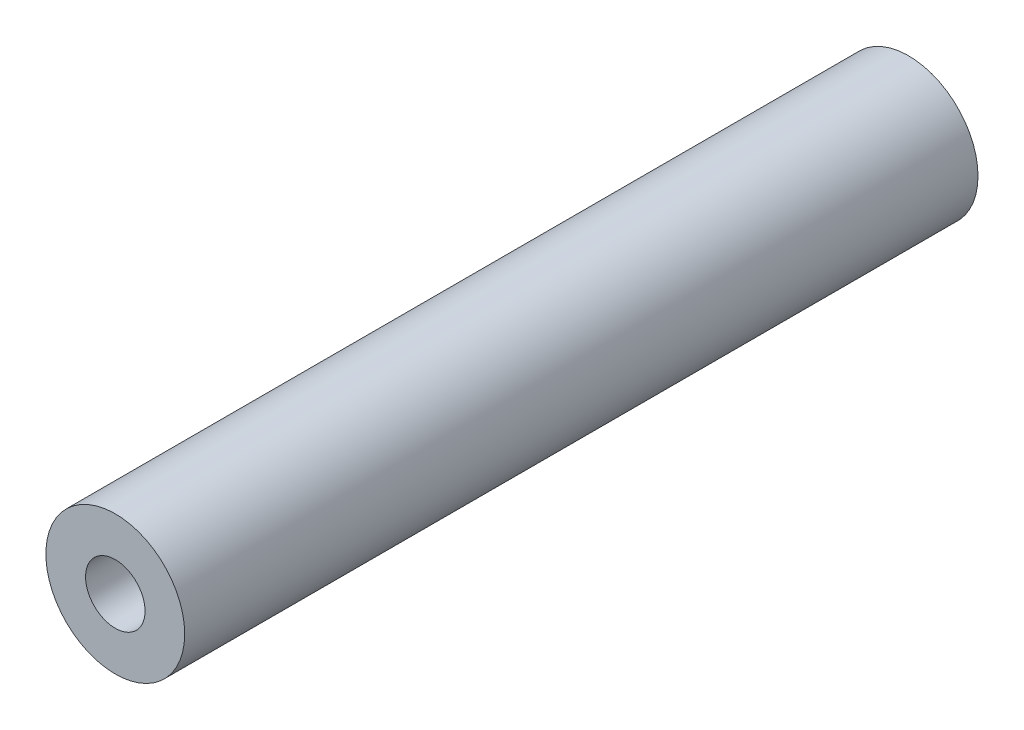
ISO-10303-21;
HEADER;
FILE_DESCRIPTION(('STEP AP214'),'2;1');
FILE_NAME('part.step','',(''),(''),'','','');
FILE_SCHEMA(('AUTOMOTIVE_DESIGN { 1 0 10303 214 1 1 1 1 }'));
ENDSEC;
DATA;
#1=APPLICATION_CONTEXT('core data for automotive mechanical design processes');
#2=APPLICATION_PROTOCOL_DEFINITION('international standard','automotive_design',2000,#1);
#3=PRODUCT_CONTEXT('',#1,'mechanical');
#4=PRODUCT('Part','Part','',(#3));
#5=PRODUCT_RELATED_PRODUCT_CATEGORY('part','',(#4));
#6=PRODUCT_DEFINITION_FORMATION('','',#4);
#7=PRODUCT_DEFINITION_CONTEXT('part definition',#1,'design');
#8=PRODUCT_DEFINITION('design','',#6,#7);
#9=PRODUCT_DEFINITION_SHAPE('','',#8);
#10=(LENGTH_UNIT() NAMED_UNIT(*) SI_UNIT(.MILLI.,.METRE.));
#11=(NAMED_UNIT(*) PLANE_ANGLE_UNIT() SI_UNIT($,.RADIAN.));
#12=(NAMED_UNIT(*) SI_UNIT($,.STERADIAN.) SOLID_ANGLE_UNIT());
#13=UNCERTAINTY_MEASURE_WITH_UNIT(LENGTH_MEASURE(1.E-05),#10,'distance_accuracy_value','');
#14=(GEOMETRIC_REPRESENTATION_CONTEXT(3) GLOBAL_UNCERTAINTY_ASSIGNED_CONTEXT((#13)) GLOBAL_UNIT_ASSIGNED_CONTEXT((#10,
#11,#12)) REPRESENTATION_CONTEXT('',''));
#15=CARTESIAN_POINT('',(0.,0.,0.));
#16=DIRECTION('',(0.,0.,1.));
#17=DIRECTION('',(1.,0.,0.));
#18=AXIS2_PLACEMENT_3D('',#15,#16,#17);
#19=CARTESIAN_POINT('',(0.,0.,40.));
#20=DIRECTION('',(0.,0.,-1.));
#21=DIRECTION('',(-1.,0.,0.));
#22=AXIS2_PLACEMENT_3D('',#19,#20,#21);
#23=CYLINDRICAL_SURFACE('',#22,3.5);
#24=CARTESIAN_POINT('',(0.,-3.5,5.4));
#25=CARTESIAN_POINT('',(0.075245103810024,-3.49999489858959,5.39999310372339));
#26=CARTESIAN_POINT('',(0.150620794863471,-3.49754506014853,5.39389757353814));
#27=CARTESIAN_POINT('',(0.299247536292527,-3.48798417170449,5.36972660753514));
#28=CARTESIAN_POINT('',(0.372492244292874,-3.48086045089214,5.35161860463971));
#29=CARTESIAN_POINT('',(0.514467745909182,-3.46271946449183,5.30418674535882));
#30=CARTESIAN_POINT('',(0.583212463131872,-3.4517149545485,5.27489960764829));
#31=CARTESIAN_POINT('',(0.714750379229858,-3.42689627557255,5.20608657867142));
#32=CARTESIAN_POINT('',(0.777545633725695,-3.4130830822064,5.16656424155675));
#33=CARTESIAN_POINT('',(0.898450705299275,-3.38331620319293,5.07643515100734));
#34=CARTESIAN_POINT('',(0.956243590785149,-3.36729607850433,5.02542534063182));
#35=CARTESIAN_POINT('',(1.06272250334931,-3.33522403834336,4.91461999756626));
#36=CARTESIAN_POINT('',(1.11140407499347,-3.31917211117655,4.85482019195178));
#37=CARTESIAN_POINT('',(1.20041219710502,-3.28805954257996,4.72490035083041));
#38=CARTESIAN_POINT('',(1.24027048683683,-3.27307481175466,4.65443945978376));
#39=CARTESIAN_POINT('',(1.307428303326,-3.24683553030755,4.50712452110597));
#40=CARTESIAN_POINT('',(1.33473379500008,-3.23557920870923,4.43027353050615));
#41=CARTESIAN_POINT('',(1.37472917637711,-3.21878450362573,4.27600136648553));
#42=CARTESIAN_POINT('',(1.38802577606395,-3.21300994248923,4.19876413509665));
#43=CARTESIAN_POINT('',(1.40152107314802,-3.20714802834401,4.04295550118491));
#44=CARTESIAN_POINT('',(1.40172621141926,-3.20705787865938,3.96438477376249));
#45=CARTESIAN_POINT('',(1.38949255725318,-3.21237350195996,3.81397032997937));
#46=CARTESIAN_POINT('',(1.3779327200136,-3.21739722526915,3.74203899991368));
#47=CARTESIAN_POINT('',(1.34396281620847,-3.23173331325485,3.6012383107953));
#48=CARTESIAN_POINT('',(1.32155085636324,-3.24104642625171,3.53236948832278));
#49=CARTESIAN_POINT('',(1.26608631278575,-3.26311639561971,3.39798751466277));
#50=CARTESIAN_POINT('',(1.23282590362072,-3.27593965496551,3.33257153266172));
#51=CARTESIAN_POINT('',(1.15675452251255,-3.30356681472923,3.2080089285469));
#52=CARTESIAN_POINT('',(1.11393996357059,-3.31837145819794,3.14886467341804));
#53=CARTESIAN_POINT('',(1.0160854196181,-3.3496871571959,3.0337131898386));
#54=CARTESIAN_POINT('',(0.960356224079444,-3.36624165483306,2.97830188938779));
#55=CARTESIAN_POINT('',(0.840220099201135,-3.39821877470797,2.87742086539857));
#56=CARTESIAN_POINT('',(0.775811445734104,-3.41364117111727,2.83195312181279));
#57=CARTESIAN_POINT('',(0.63845435682409,-3.44200276885184,2.75146778680892));
#58=CARTESIAN_POINT('',(0.565362343942534,-3.4548868906679,2.71667440316206));
#59=CARTESIAN_POINT('',(0.413716635838017,-3.47630379830131,2.66008249724536));
#60=CARTESIAN_POINT('',(0.335165737794772,-3.48483879423668,2.63827737370981));
#61=CARTESIAN_POINT('',(0.179827121325474,-3.49619297654837,2.60948619320621));
#62=CARTESIAN_POINT('',(0.103210305789874,-3.4993206208346,2.60169928202251));
#63=CARTESIAN_POINT('',(-0.050291716865472,-3.50047934957442,2.59880082962997));
#64=CARTESIAN_POINT('',(-0.127176849256747,-3.49851175507604,2.60368600291674));
#65=CARTESIAN_POINT('',(-0.275402917385392,-3.48990296944627,2.62540422678639));
#66=CARTESIAN_POINT('',(-0.346837744242833,-3.48347573941866,2.64169058624568));
#67=CARTESIAN_POINT('',(-0.485894799642547,-3.4668160898385,2.68500499581687));
#68=CARTESIAN_POINT('',(-0.553516537157392,-3.45658318149571,2.71203442576808));
#69=CARTESIAN_POINT('',(-0.685355150071692,-3.43291616339568,2.77694945777596));
#70=CARTESIAN_POINT('',(-0.749404615928784,-3.41939371185862,2.8151418304302));
#71=CARTESIAN_POINT('',(-0.870410513872589,-3.39061355321867,2.90095822673395));
#72=CARTESIAN_POINT('',(-0.927364088532788,-3.37535515177189,2.94858603004583));
#73=CARTESIAN_POINT('',(-1.03650613012017,-3.34351582346678,3.05560900906474));
#74=CARTESIAN_POINT('',(-1.08813175366425,-3.32691408997536,3.11557347905435));
#75=CARTESIAN_POINT('',(-1.1807258381896,-3.29519171041993,3.24360805810656));
#76=CARTESIAN_POINT('',(-1.22169254293626,-3.28007130868558,3.31167950023796));
#77=CARTESIAN_POINT('',(-1.29206525135214,-3.25300009935396,3.45502318621587));
#78=CARTESIAN_POINT('',(-1.32135541617412,-3.24108141619351,3.53035879944862));
#79=CARTESIAN_POINT('',(-1.36660735379371,-3.22226571434552,3.68551355620061));
#80=CARTESIAN_POINT('',(-1.38257896368852,-3.21536498987199,3.7653293440687));
#81=CARTESIAN_POINT('',(-1.39980093209488,-3.20790231509948,3.92098953124218));
#82=CARTESIAN_POINT('',(-1.40202795761201,-3.2069199470572,3.99670638771535));
#83=CARTESIAN_POINT('',(-1.39426221149427,-3.21030385223168,4.14738140039931));
#84=CARTESIAN_POINT('',(-1.38427099153965,-3.21466944627355,4.22233965173181));
#85=CARTESIAN_POINT('',(-1.35314995630755,-3.22788654355314,4.36633253289853));
#86=CARTESIAN_POINT('',(-1.33247624549968,-3.23655382279215,4.4354841921031));
#87=CARTESIAN_POINT('',(-1.28100381394371,-3.25726800862888,4.56936504072944));
#88=CARTESIAN_POINT('',(-1.25020229697567,-3.26931584844205,4.63409300282988));
#89=CARTESIAN_POINT('',(-1.17731093393181,-3.29629026723144,4.76132673348955));
#90=CARTESIAN_POINT('',(-1.13467573461164,-3.31134217619269,4.82349306909134));
#91=CARTESIAN_POINT('',(-1.04012448349005,-3.34224663060566,4.94009532204263));
#92=CARTESIAN_POINT('',(-0.988205634372684,-3.35809941633885,4.99452890048982));
#93=CARTESIAN_POINT('',(-0.872553854390723,-3.39005496961176,5.09774199728453));
#94=CARTESIAN_POINT('',(-0.808273200802296,-3.4061073057353,5.14592611482865));
#95=CARTESIAN_POINT('',(-0.671930224200045,-3.43560284699602,5.23083592983515));
#96=CARTESIAN_POINT('',(-0.599864303183066,-3.44904483765034,5.26755629850677));
#97=CARTESIAN_POINT('',(-0.451316643746642,-3.47157800371103,5.3276355506332));
#98=CARTESIAN_POINT('',(-0.374942132753787,-3.48074554138519,5.35123052649224));
#99=CARTESIAN_POINT('',(-0.219013582396855,-3.49401014346556,5.38504738466799));
#100=CARTESIAN_POINT('',(-0.139470468101239,-3.49812329646947,5.39531170572073));
#101=CARTESIAN_POINT('',(-0.0398386085236506,-3.49983129652896,5.39957676668479));
#102=CARTESIAN_POINT('',(-0.0199238821185308,-3.50000135078423,5.40000182604044));
#103=CARTESIAN_POINT('',(0.,-3.5,5.4));
#104=B_SPLINE_CURVE_WITH_KNOTS('',3,(#24,#25,#26,#27,#28,#29,#30,#31,#32,#33,#34,#35,#36,#37,
#38,#39,#40,#41,#42,#43,#44,#45,#46,#47,#48,#49,#50,#51,#52,#53,#54,#55,#56,#57,#58,#59,#60,#61,
#62,#63,#64,#65,#66,#67,#68,#69,#70,#71,#72,#73,#74,#75,#76,#77,#78,#79,#80,#81,#82,#83,#84,#85,
#86,#87,#88,#89,#90,#91,#92,#93,#94,#95,#96,#97,#98,#99,#100,#101,#102,#103),.UNSPECIFIED.,.T.,
.F.,(4,2,2,2,2,2,2,2,2,2,2,2,2,2,2,2,2,2,2,2,2,2,2,2,2,2,2,2,2,2,2,2,2,2,2,2,2,2,2,4),(0.,
0.22568209152515,0.451978545205554,0.677538020230108,0.90301927497589,1.13818167190278,
1.37345876454088,1.61920681173452,1.86483796182788,2.0993287371618,2.33370414438342,
2.55176829880961,2.76987051079233,2.99242388409171,3.21506095356728,3.4549084443059,
3.69480364987813,3.93943839213964,4.18394869279653,4.41398429169605,4.64396025499058,
4.86360318895056,5.08327434295658,5.30966459378784,5.53614571649278,5.7775793223709,
6.01905268330624,6.26286531598579,6.50649770852154,6.73259771374923,6.95866900794132,
7.17580022984138,7.39299145063613,7.62261827639685,7.85231440943875,8.09690296473685,
8.34160504548373,8.58175010709323,8.82112876683039,8.88088632127757),.UNSPECIFIED.);
#105=CARTESIAN_POINT('',(0.,-3.5,5.4));
#106=VERTEX_POINT('',#105);
#107=EDGE_CURVE('E58',#106,#106,#104,.T.);
#108=ORIENTED_EDGE('',*,*,#107,.T.);
#109=EDGE_LOOP('',(#108));
#110=FACE_BOUND('',#109,.T.);
#111=CARTESIAN_POINT('',(0.,-3.5,37.4));
#112=CARTESIAN_POINT('',(0.0752451038100239,-3.49999489858959,37.3999931037234));
#113=CARTESIAN_POINT('',(0.150620794863471,-3.49754506014853,37.3938975735381));
#114=CARTESIAN_POINT('',(0.299247536292527,-3.48798417170449,37.3697266075351));
#115=CARTESIAN_POINT('',(0.372492244292873,-3.48086045089214,37.3516186046397));
#116=CARTESIAN_POINT('',(0.51446774590918,-3.46271946449183,37.3041867453588));
#117=CARTESIAN_POINT('',(0.583212463131869,-3.45171495454851,37.2748996076483));
#118=CARTESIAN_POINT('',(0.714750379229855,-3.42689627557255,37.2060865786714));
#119=CARTESIAN_POINT('',(0.777545633725692,-3.4130830822064,37.1665642415568));
#120=CARTESIAN_POINT('',(0.898450705299273,-3.38331620319293,37.0764351510074));
#121=CARTESIAN_POINT('',(0.956243590785147,-3.36729607850433,37.0254253406318));
#122=CARTESIAN_POINT('',(1.0627225033493,-3.33522403834336,36.9146199975663));
#123=CARTESIAN_POINT('',(1.11140407499347,-3.31917211117655,36.8548201919518));
#124=CARTESIAN_POINT('',(1.20041219710502,-3.28805954257995,36.7249003508304));
#125=CARTESIAN_POINT('',(1.24027048683683,-3.27307481175466,36.6544394597838));
#126=CARTESIAN_POINT('',(1.307428303326,-3.24683553030755,36.507124521106));
#127=CARTESIAN_POINT('',(1.33473379500008,-3.23557920870923,36.4302735305061));
#128=CARTESIAN_POINT('',(1.37472917637711,-3.21878450362573,36.2760013664855));
#129=CARTESIAN_POINT('',(1.38802577606395,-3.21300994248924,36.1987641350967));
#130=CARTESIAN_POINT('',(1.40152107314802,-3.20714802834401,36.0429555011849));
#131=CARTESIAN_POINT('',(1.40172621141925,-3.20705787865938,35.9643847737625));
#132=CARTESIAN_POINT('',(1.38949255725318,-3.21237350195996,35.8139703299794));
#133=CARTESIAN_POINT('',(1.3779327200136,-3.21739722526915,35.7420389999137));
#134=CARTESIAN_POINT('',(1.34396281620847,-3.23173331325485,35.6012383107953));
#135=CARTESIAN_POINT('',(1.32155085636324,-3.24104642625171,35.5323694883228));
#136=CARTESIAN_POINT('',(1.26608631278575,-3.26311639561971,35.3979875146628));
#137=CARTESIAN_POINT('',(1.23282590362072,-3.27593965496551,35.3325715326617));
#138=CARTESIAN_POINT('',(1.15675452251255,-3.30356681472923,35.2080089285469));
#139=CARTESIAN_POINT('',(1.11393996357059,-3.31837145819794,35.148864673418));
#140=CARTESIAN_POINT('',(1.01608541961811,-3.34968715719589,35.0337131898386));
#141=CARTESIAN_POINT('',(0.960356224079448,-3.36624165483306,34.9783018893878));
#142=CARTESIAN_POINT('',(0.840220099201137,-3.39821877470797,34.8774208653986));
#143=CARTESIAN_POINT('',(0.775811445734104,-3.41364117111727,34.8319531218128));
#144=CARTESIAN_POINT('',(0.63845435682409,-3.44200276885184,34.7514677868089));
#145=CARTESIAN_POINT('',(0.565362343942534,-3.4548868906679,34.7166744031621));
#146=CARTESIAN_POINT('',(0.413716635838019,-3.47630379830131,34.6600824972454));
#147=CARTESIAN_POINT('',(0.335165737794774,-3.48483879423668,34.6382773737098));
#148=CARTESIAN_POINT('',(0.179827121325478,-3.49619297654837,34.6094861932062));
#149=CARTESIAN_POINT('',(0.103210305789878,-3.4993206208346,34.6016992820225));
#150=CARTESIAN_POINT('',(-0.0502917168654688,-3.50047934957442,34.59880082963));
#151=CARTESIAN_POINT('',(-0.127176849256743,-3.49851175507604,34.6036860029168));
#152=CARTESIAN_POINT('',(-0.275402917385389,-3.48990296944627,34.6254042267864));
#153=CARTESIAN_POINT('',(-0.346837744242831,-3.48347573941866,34.6416905862457));
#154=CARTESIAN_POINT('',(-0.485894799642546,-3.4668160898385,34.6850049958169));
#155=CARTESIAN_POINT('',(-0.55351653715739,-3.45658318149571,34.7120344257681));
#156=CARTESIAN_POINT('',(-0.685355150071688,-3.43291616339568,34.776949457776));
#157=CARTESIAN_POINT('',(-0.74940461592878,-3.41939371185863,34.8151418304302));
#158=CARTESIAN_POINT('',(-0.870410513872586,-3.39061355321867,34.900958226734));
#159=CARTESIAN_POINT('',(-0.927364088532787,-3.37535515177189,34.9485860300458));
#160=CARTESIAN_POINT('',(-1.03650613012017,-3.34351582346678,35.0556090090647));
#161=CARTESIAN_POINT('',(-1.08813175366424,-3.32691408997536,35.1155734790543));
#162=CARTESIAN_POINT('',(-1.18072583818959,-3.29519171041993,35.2436080581066));
#163=CARTESIAN_POINT('',(-1.22169254293625,-3.28007130868558,35.311679500238));
#164=CARTESIAN_POINT('',(-1.29206525135214,-3.25300009935396,35.4550231862159));
#165=CARTESIAN_POINT('',(-1.32135541617412,-3.24108141619352,35.5303587994486));
#166=CARTESIAN_POINT('',(-1.36660735379371,-3.22226571434552,35.6855135562006));
#167=CARTESIAN_POINT('',(-1.38257896368852,-3.21536498987199,35.7653293440687));
#168=CARTESIAN_POINT('',(-1.39980093209488,-3.20790231509948,35.9209895312422));
#169=CARTESIAN_POINT('',(-1.40202795761201,-3.2069199470572,35.9967063877153));
#170=CARTESIAN_POINT('',(-1.39426221149427,-3.21030385223169,36.1473814003993));
#171=CARTESIAN_POINT('',(-1.38427099153965,-3.21466944627356,36.2223396517318));
#172=CARTESIAN_POINT('',(-1.35314995630755,-3.22788654355315,36.3663325328985));
#173=CARTESIAN_POINT('',(-1.33247624549968,-3.23655382279215,36.4354841921031));
#174=CARTESIAN_POINT('',(-1.28100381394371,-3.25726800862888,36.5693650407294));
#175=CARTESIAN_POINT('',(-1.25020229697567,-3.26931584844205,36.6340930028299));
#176=CARTESIAN_POINT('',(-1.17731093393181,-3.29629026723144,36.7613267334896));
#177=CARTESIAN_POINT('',(-1.13467573461164,-3.31134217619269,36.8234930690913));
#178=CARTESIAN_POINT('',(-1.04012448349005,-3.34224663060566,36.9400953220426));
#179=CARTESIAN_POINT('',(-0.988205634372686,-3.35809941633885,36.9945289004898));
#180=CARTESIAN_POINT('',(-0.872553854390725,-3.39005496961176,37.0977419972845));
#181=CARTESIAN_POINT('',(-0.808273200802296,-3.4061073057353,37.1459261148286));
#182=CARTESIAN_POINT('',(-0.671930224200044,-3.43560284699602,37.2308359298352));
#183=CARTESIAN_POINT('',(-0.599864303183065,-3.44904483765034,37.2675562985068));
#184=CARTESIAN_POINT('',(-0.451316643746642,-3.47157800371103,37.3276355506332));
#185=CARTESIAN_POINT('',(-0.374942132753788,-3.48074554138519,37.3512305264922));
#186=CARTESIAN_POINT('',(-0.219013582396855,-3.49401014346556,37.385047384668));
#187=CARTESIAN_POINT('',(-0.139470468101239,-3.49812329646947,37.3953117057207));
#188=CARTESIAN_POINT('',(-0.0398386085236501,-3.49983129652896,37.3995767666848));
#189=CARTESIAN_POINT('',(-0.0199238821185305,-3.50000135078423,37.4000018260404));
#190=CARTESIAN_POINT('',(0.,-3.5,37.4));
#191=B_SPLINE_CURVE_WITH_KNOTS('',3,(#111,#112,#113,#114,#115,#116,#117,#118,#119,#120,#121,
#122,#123,#124,#125,#126,#127,#128,#129,#130,#131,#132,#133,#134,#135,#136,#137,#138,#139,#140,
#141,#142,#143,#144,#145,#146,#147,#148,#149,#150,#151,#152,#153,#154,#155,#156,#157,#158,#159,
#160,#161,#162,#163,#164,#165,#166,#167,#168,#169,#170,#171,#172,#173,#174,#175,#176,#177,#178,
#179,#180,#181,#182,#183,#184,#185,#186,#187,#188,#189,#190),.UNSPECIFIED.,.T.,.F.,(4,2,2,2,2,2,
2,2,2,2,2,2,2,2,2,2,2,2,2,2,2,2,2,2,2,2,2,2,2,2,2,2,2,2,2,2,2,2,2,4),(0.,0.22568209152515,
0.451978545205553,0.677538020230103,0.903019274975888,1.13818167190278,1.37345876454088,
1.61920681173452,1.86483796182788,2.0993287371618,2.33370414438341,2.5517682988096,
2.76987051079233,2.99242388409171,3.21506095356728,3.45490844430589,3.69480364987813,
3.93943839213964,4.18394869279653,4.41398429169605,4.64396025499057,4.86360318895056,
5.08327434295657,5.30966459378783,5.53614571649278,5.77757932237089,6.01905268330623,
6.26286531598579,6.50649770852154,6.73259771374923,6.95866900794132,7.17580022984138,
7.39299145063613,7.62261827639684,7.85231440943875,8.09690296473685,8.34160504548373,
8.58175010709322,8.82112876683039,8.88088632127756),.UNSPECIFIED.);
#192=CARTESIAN_POINT('',(0.,-3.5,37.4));
#193=VERTEX_POINT('',#192);
#194=EDGE_CURVE('E76',#193,#193,#191,.T.);
#195=ORIENTED_EDGE('',*,*,#194,.T.);
#196=EDGE_LOOP('',(#195));
#197=FACE_BOUND('',#196,.T.);
#198=CARTESIAN_POINT('',(0.,0.,40.));
#199=DIRECTION('',(0.,0.,1.));
#200=DIRECTION('',(1.,0.,0.));
#201=AXIS2_PLACEMENT_3D('',#198,#199,#200);
#202=CIRCLE('',#201,3.5);
#203=CARTESIAN_POINT('',(3.5,0.,40.));
#204=VERTEX_POINT('',#203);
#205=EDGE_CURVE('E10',#204,#204,#202,.T.);
#206=ORIENTED_EDGE('',*,*,#205,.F.);
#207=EDGE_LOOP('',(#206));
#208=FACE_BOUND('',#207,.T.);
#209=CARTESIAN_POINT('',(0.,0.,0.));
#210=DIRECTION('',(0.,0.,1.));
#211=DIRECTION('',(1.,0.,0.));
#212=AXIS2_PLACEMENT_3D('',#209,#210,#211);
#213=CIRCLE('',#212,3.5);
#214=CARTESIAN_POINT('',(3.5,0.,0.));
#215=VERTEX_POINT('',#214);
#216=EDGE_CURVE('E42',#215,#215,#213,.T.);
#217=ORIENTED_EDGE('',*,*,#216,.T.);
#218=EDGE_LOOP('',(#217));
#219=FACE_BOUND('',#218,.T.);
#220=ADVANCED_FACE('F30',(#110,#197,#208,#219),#23,.T.);
#221=CARTESIAN_POINT('',(0.,0.,40.));
#222=DIRECTION('',(0.,0.,1.));
#223=DIRECTION('',(1.,0.,0.));
#224=AXIS2_PLACEMENT_3D('',#221,#222,#223);
#225=PLANE('',#224);
#226=CARTESIAN_POINT('',(0.,0.,40.));
#227=DIRECTION('',(0.,0.,1.));
#228=DIRECTION('',(1.,0.,0.));
#229=AXIS2_PLACEMENT_3D('',#226,#227,#228);
#230=CIRCLE('',#229,1.5);
#231=CARTESIAN_POINT('',(1.5,0.,40.));
#232=VERTEX_POINT('',#231);
#233=EDGE_CURVE('E50',#232,#232,#230,.T.);
#234=ORIENTED_EDGE('',*,*,#233,.F.);
#235=EDGE_LOOP('',(#234));
#236=FACE_BOUND('',#235,.T.);
#237=ORIENTED_EDGE('',*,*,#205,.T.);
#238=EDGE_LOOP('',(#237));
#239=FACE_BOUND('',#238,.T.);
#240=ADVANCED_FACE('F94',(#236,#239),#225,.T.);
#241=CARTESIAN_POINT('',(0.,0.,0.));
#242=DIRECTION('',(0.,0.,1.));
#243=DIRECTION('',(1.,0.,0.));
#244=AXIS2_PLACEMENT_3D('',#241,#242,#243);
#245=PLANE('',#244);
#246=CARTESIAN_POINT('',(0.,0.,0.));
#247=DIRECTION('',(0.,0.,-1.));
#248=DIRECTION('',(-1.,0.,0.));
#249=AXIS2_PLACEMENT_3D('',#246,#247,#248);
#250=CIRCLE('',#249,2.);
#251=CARTESIAN_POINT('',(-2.,0.,0.));
#252=VERTEX_POINT('',#251);
#253=EDGE_CURVE('E81',#252,#252,#250,.T.);
#254=ORIENTED_EDGE('',*,*,#253,.F.);
#255=EDGE_LOOP('',(#254));
#256=FACE_BOUND('',#255,.T.);
#257=ORIENTED_EDGE('',*,*,#216,.F.);
#258=EDGE_LOOP('',(#257));
#259=FACE_BOUND('',#258,.T.);
#260=ADVANCED_FACE('F96',(#256,#259),#245,.F.);
#261=CARTESIAN_POINT('',(0.,0.,25.));
#262=DIRECTION('',(0.,0.,1.));
#263=DIRECTION('',(1.,0.,0.));
#264=AXIS2_PLACEMENT_3D('',#261,#262,#263);
#265=CYLINDRICAL_SURFACE('',#264,1.5);
#266=CARTESIAN_POINT('',(0.,-1.5,37.4));
#267=CARTESIAN_POINT('',(-0.0640950435898012,-1.49999810476752,37.3999980825945));
#268=CARTESIAN_POINT('',(-0.128203261420188,-1.49585775722874,37.3955646080593));
#269=CARTESIAN_POINT('',(-0.254231511438517,-1.47966634077285,37.378195233187));
#270=CARTESIAN_POINT('',(-0.316149985383407,-1.46760975338439,37.3652534016011));
#271=CARTESIAN_POINT('',(-0.435653650258473,-1.43666147835234,37.3319287185882));
#272=CARTESIAN_POINT('',(-0.493263524025158,-1.41781301737499,37.3115929186134));
#273=CARTESIAN_POINT('',(-0.603545856251819,-1.37449949866094,37.2646464311466));
#274=CARTESIAN_POINT('',(-0.65621711157044,-1.35003307726335,37.2380342201238));
#275=CARTESIAN_POINT('',(-0.776384430557704,-1.28590636968926,37.1678338611699));
#276=CARTESIAN_POINT('',(-0.841263828075761,-1.24410257595713,37.1217324601478));
#277=CARTESIAN_POINT('',(-0.96032201844431,-1.15470724278931,37.0216967122515));
#278=CARTESIAN_POINT('',(-1.01446437813477,-1.10709685378308,36.9677367383278));
#279=CARTESIAN_POINT('',(-1.09410972403101,-1.02704790659367,36.8747329836239));
#280=CARTESIAN_POINT('',(-1.12279412607445,-0.995519007918941,36.8375640334999));
#281=CARTESIAN_POINT('',(-1.17611972721624,-0.93191324772849,36.7608711692357));
#282=CARTESIAN_POINT('',(-1.2007615679446,-0.899836474064837,36.7213476301729));
#283=CARTESIAN_POINT('',(-1.24603236281641,-0.836020509823156,36.6399750587856));
#284=CARTESIAN_POINT('',(-1.26666963134969,-0.804280751986893,36.5981310817456));
#285=CARTESIAN_POINT('',(-1.30397463905043,-0.742259923002764,36.5117283809489));
#286=CARTESIAN_POINT('',(-1.32064768489069,-0.711976945588823,36.4671733878273));
#287=CARTESIAN_POINT('',(-1.3455836380728,-0.663266720561956,36.3880534896935));
#288=CARTESIAN_POINT('',(-1.35488117906104,-0.643957516465631,36.3543645504116));
#289=CARTESIAN_POINT('',(-1.37118437959276,-0.608466763372423,36.2848275746981));
#290=CARTESIAN_POINT('',(-1.37819290740772,-0.592281310616895,36.2489823075263));
#291=CARTESIAN_POINT('',(-1.38840796727428,-0.567859576833389,36.1822677555684));
#292=CARTESIAN_POINT('',(-1.39209375995248,-0.558682061093194,36.151829672968));
#293=CARTESIAN_POINT('',(-1.39746406931907,-0.545114614701663,36.0897632705108));
#294=CARTESIAN_POINT('',(-1.39915451710864,-0.540710498474953,36.0581387678841));
#295=CARTESIAN_POINT('',(-1.40035374267596,-0.537599996851102,35.9943352214479));
#296=CARTESIAN_POINT('',(-1.39984783727429,-0.538931958112776,35.962153882424));
#297=CARTESIAN_POINT('',(-1.39668645166934,-0.547068022818477,35.8985766065242));
#298=CARTESIAN_POINT('',(-1.39402593509137,-0.553884947048083,35.8671826876862));
#299=CARTESIAN_POINT('',(-1.38521762880518,-0.575636746274777,35.7922334938856));
#300=CARTESIAN_POINT('',(-1.37804463752851,-0.592834579615153,35.7494862127565));
#301=CARTESIAN_POINT('',(-1.36047366336353,-0.632121556262389,35.6669749164486));
#302=CARTESIAN_POINT('',(-1.35006160055544,-0.654231931595371,35.6272248858585));
#303=CARTESIAN_POINT('',(-1.32552237625272,-0.70269628329877,35.5473913256953));
#304=CARTESIAN_POINT('',(-1.31118060350002,-0.729241700735491,35.5074925412539));
#305=CARTESIAN_POINT('',(-1.27936813596317,-0.783721365900131,35.4299364144922));
#306=CARTESIAN_POINT('',(-1.26189443887906,-0.811656927510191,35.3922812695116));
#307=CARTESIAN_POINT('',(-1.20478652543379,-0.896155419621896,35.2821176468105));
#308=CARTESIAN_POINT('',(-1.16048231756084,-0.95337431394899,35.2124642022287));
#309=CARTESIAN_POINT('',(-1.05478065478574,-1.06965744462516,35.0750355708551));
#310=CARTESIAN_POINT('',(-0.992261512967609,-1.12847418664172,35.0079074751663));
#311=CARTESIAN_POINT('',(-0.85141002169809,-1.23814274705326,34.8847539738801));
#312=CARTESIAN_POINT('',(-0.773142733697489,-1.28902585520104,34.8286847083159));
#313=CARTESIAN_POINT('',(-0.634633965334391,-1.36042050484592,34.7506477807863));
#314=CARTESIAN_POINT('',(-0.579198330935333,-1.38505239417212,34.7238933807811));
#315=CARTESIAN_POINT('',(-0.463160810398619,-1.4280397544885,34.6773593374095));
#316=CARTESIAN_POINT('',(-0.402562624032901,-1.4463996738265,34.6575747504429));
#317=CARTESIAN_POINT('',(-0.276983848656247,-1.475623044531,34.626137936862));
#318=CARTESIAN_POINT('',(-0.21197302764821,-1.48642750320128,34.6145496991178));
#319=CARTESIAN_POINT('',(-0.0801160458413315,-1.49931930239748,34.6007269777605));
#320=CARTESIAN_POINT('',(-0.0132710845924479,-1.50141220975984,34.598486520747));
#321=CARTESIAN_POINT('',(0.1120735776974,-1.49696964573209,34.603247248845));
#322=CARTESIAN_POINT('',(0.170652011170823,-1.4913952065305,34.6092190804513));
#323=CARTESIAN_POINT('',(0.285623868807213,-1.47370383429039,34.6282074233806));
#324=CARTESIAN_POINT('',(0.342016932768793,-1.46158582758908,34.6412250907789));
#325=CARTESIAN_POINT('',(0.452069353137241,-1.43141048145882,34.6737371718716));
#326=CARTESIAN_POINT('',(0.50568204136064,-1.41327584920924,34.6933159073675));
#327=CARTESIAN_POINT('',(0.608545419511086,-1.37213205058534,34.7379300815498));
#328=CARTESIAN_POINT('',(0.65779495126971,-1.34912159542401,34.7629669629945));
#329=CARTESIAN_POINT('',(0.774905239500955,-1.2867969815693,34.8311862042441));
#330=CARTESIAN_POINT('',(0.839835145764479,-1.24506704156328,34.8771990730574));
#331=CARTESIAN_POINT('',(0.959012907346228,-1.15579651396183,34.977073570626));
#332=CARTESIAN_POINT('',(1.01322173952654,-1.1082356841826,35.0309626739718));
#333=CARTESIAN_POINT('',(1.09299741825808,-1.02823308499649,35.123876408531));
#334=CARTESIAN_POINT('',(1.12174188597574,-0.996706108059433,35.1610262581766));
#335=CARTESIAN_POINT('',(1.17518389937803,-0.933094902772498,35.2376830315749));
#336=CARTESIAN_POINT('',(1.19988206631047,-0.901010760805008,35.2771895922177));
#337=CARTESIAN_POINT('',(1.24526127527265,-0.837170486279038,35.3585252313268));
#338=CARTESIAN_POINT('',(1.26595084875642,-0.805413796381667,35.4003491281506));
#339=CARTESIAN_POINT('',(1.30335948831333,-0.743341967384873,35.4867068554011));
#340=CARTESIAN_POINT('',(1.32008381854399,-0.713024960272842,35.531236993236));
#341=CARTESIAN_POINT('',(1.34511797808286,-0.664212866891965,35.6103336691824));
#342=CARTESIAN_POINT('',(1.35446014448859,-0.644845095295752,35.6440281578057));
#343=CARTESIAN_POINT('',(1.37085233157459,-0.609217069989049,35.7135763951788));
#344=CARTESIAN_POINT('',(1.37790509960865,-0.592953101348057,35.7494274941972));
#345=CARTESIAN_POINT('',(1.38820652789297,-0.568353829326476,35.8161960016788));
#346=CARTESIAN_POINT('',(1.391932093237,-0.559085985696122,35.8466830443762));
#347=CARTESIAN_POINT('',(1.39737637039699,-0.54534068856858,35.9088617889395));
#348=CARTESIAN_POINT('',(1.39910109458525,-0.540848886849111,35.9405495847198));
#349=CARTESIAN_POINT('',(1.40035973091953,-0.537584750109142,36.0045040503349));
#350=CARTESIAN_POINT('',(1.39987845791979,-0.53885205783399,36.0367732048758));
#351=CARTESIAN_POINT('',(1.39675296913251,-0.546897751695353,36.100531883667));
#352=CARTESIAN_POINT('',(1.39410369235148,-0.553689032784739,36.1320194058803));
#353=CARTESIAN_POINT('',(1.38533400478294,-0.575354619595597,36.2069690999879));
#354=CARTESIAN_POINT('',(1.37820148371112,-0.592466426255628,36.2496354566346));
#355=CARTESIAN_POINT('',(1.36072269539434,-0.631581922223773,36.3319953873768));
#356=CARTESIAN_POINT('',(1.35036241654719,-0.65360681838119,36.371675045427));
#357=CARTESIAN_POINT('',(1.32593952026709,-0.701904795351851,36.4513778001375));
#358=CARTESIAN_POINT('',(1.31166241918742,-0.728370349638927,36.4912159467709));
#359=CARTESIAN_POINT('',(1.2799919308485,-0.78269806127693,36.568655614103));
#360=CARTESIAN_POINT('',(1.26259554667872,-0.810561543006726,36.6062549371201));
#361=CARTESIAN_POINT('',(1.20574017213928,-0.894856217334772,36.7162596645097));
#362=CARTESIAN_POINT('',(1.16163188907002,-0.951955537375637,36.7858181417855));
#363=CARTESIAN_POINT('',(1.05634821026602,-1.0680971135822,36.9231617830248));
#364=CARTESIAN_POINT('',(0.994041431180782,-1.12689249469875,36.9902945626943));
#365=CARTESIAN_POINT('',(0.853650451916167,-1.236586959315,37.1135198745008));
#366=CARTESIAN_POINT('',(0.775629528593137,-1.28751630848163,37.1696549577771));
#367=CARTESIAN_POINT('',(0.637389969831997,-1.3591340324726,37.2479519382324));
#368=CARTESIAN_POINT('',(0.581954261174712,-1.38390076155342,37.2748569862137));
#369=CARTESIAN_POINT('',(0.465902765083793,-1.42714809783519,37.3216783376014));
#370=CARTESIAN_POINT('',(0.405293380022253,-1.44563633743585,37.3416031274463));
#371=CARTESIAN_POINT('',(0.287701636863421,-1.47323624823742,37.3712952871517));
#372=CARTESIAN_POINT('',(0.231158713475276,-1.48320773635011,37.3819955656655));
#373=CARTESIAN_POINT('',(0.116413915443561,-1.49658978512848,37.3963480539911));
#374=CARTESIAN_POINT('',(0.0582123911955961,-1.50000172128777,37.4000017414257));
#375=CARTESIAN_POINT('',(0.,-1.5,37.4));
#376=B_SPLINE_CURVE_WITH_KNOTS('',3,(#266,#267,#268,#269,#270,#271,#272,#273,#274,#275,#276,
#277,#278,#279,#280,#281,#282,#283,#284,#285,#286,#287,#288,#289,#290,#291,#292,#293,#294,#295,
#296,#297,#298,#299,#300,#301,#302,#303,#304,#305,#306,#307,#308,#309,#310,#311,#312,#313,#314,
#315,#316,#317,#318,#319,#320,#321,#322,#323,#324,#325,#326,#327,#328,#329,#330,#331,#332,#333,
#334,#335,#336,#337,#338,#339,#340,#341,#342,#343,#344,#345,#346,#347,#348,#349,#350,#351,#352,
#353,#354,#355,#356,#357,#358,#359,#360,#361,#362,#363,#364,#365,#366,#367,#368,#369,#370,#371,
#372,#373,#374,#375),.UNSPECIFIED.,.T.,.F.,(4,2,2,2,2,2,2,2,2,2,2,2,2,2,2,2,2,2,2,2,2,2,2,2,2,2,
2,2,2,2,2,2,2,2,2,2,2,2,2,2,2,2,2,2,2,2,2,2,2,2,2,2,2,2,4),(0.,0.192034994137711,
0.384203999672065,0.575170949569546,0.766184302421697,1.03442966670877,1.30357023259321,
1.47305672379125,1.64251628823541,1.81162016104472,1.98049637358934,2.10012258777771,
2.2195983228114,2.31527378863355,2.41066414011568,2.50669317880214,2.60294733419629,
2.74205298274738,2.88177196436229,3.03162025591018,3.1816129696533,3.48179547070571,
3.80714557744452,4.13117816597864,4.32935579745821,4.52739257968973,4.72695886112303,
4.9263975965518,5.10298783695106,5.27960706092889,5.45858926037756,5.63761882789577,
5.90571777053038,6.17477528621027,6.34431145277164,6.51382156519503,6.6829668493351,
6.85188630708465,6.97164384583516,7.09125713567699,7.18716467143601,7.2827832598322,
7.37906103052147,7.47556419557814,7.61433586808764,7.75371854133864,7.90323945867087,
8.05290480840866,8.35243418141267,8.67740355837053,9.00108962784138,9.19960579754515,
9.39787977134162,9.57232635013024,9.74673634466166),.UNSPECIFIED.);
#377=CARTESIAN_POINT('',(0.,-1.5,37.4));
#378=VERTEX_POINT('',#377);
#379=EDGE_CURVE('E34',#378,#378,#376,.T.);
#380=ORIENTED_EDGE('',*,*,#379,.T.);
#381=EDGE_LOOP('',(#380));
#382=FACE_BOUND('',#381,.T.);
#383=CARTESIAN_POINT('',(0.,0.,25.));
#384=DIRECTION('',(0.,0.,1.));
#385=DIRECTION('',(1.,0.,0.));
#386=AXIS2_PLACEMENT_3D('',#383,#384,#385);
#387=CIRCLE('',#386,1.5);
#388=CARTESIAN_POINT('',(1.5,0.,25.));
#389=VERTEX_POINT('',#388);
#390=EDGE_CURVE('E47',#389,#389,#387,.T.);
#391=ORIENTED_EDGE('',*,*,#390,.F.);
#392=EDGE_LOOP('',(#391));
#393=FACE_BOUND('',#392,.T.);
#394=ORIENTED_EDGE('',*,*,#233,.T.);
#395=EDGE_LOOP('',(#394));
#396=FACE_BOUND('',#395,.T.);
#397=ADVANCED_FACE('F92',(#382,#393,#396),#265,.F.);
#398=CARTESIAN_POINT('',(0.,0.,25.));
#399=DIRECTION('',(0.,0.,1.));
#400=DIRECTION('',(1.,0.,0.));
#401=AXIS2_PLACEMENT_3D('',#398,#399,#400);
#402=PLANE('',#401);
#403=ORIENTED_EDGE('',*,*,#390,.T.);
#404=EDGE_LOOP('',(#403));
#405=FACE_BOUND('',#404,.T.);
#406=ADVANCED_FACE('F106',(#405),#402,.T.);
#407=CARTESIAN_POINT('',(0.,0.,15.));
#408=DIRECTION('',(0.,0.,-1.));
#409=DIRECTION('',(-1.,0.,0.));
#410=AXIS2_PLACEMENT_3D('',#407,#408,#409);
#411=CYLINDRICAL_SURFACE('',#410,2.);
#412=CARTESIAN_POINT('',(0.,-2.,5.4));
#413=CARTESIAN_POINT('',(-0.0696218245045326,-2.00000334348146,5.400003611991));
#414=CARTESIAN_POINT('',(-0.139225061066501,-1.99633557873339,5.39477960370134));
#415=CARTESIAN_POINT('',(-0.276187041587795,-1.98203504075958,5.37423335865938));
#416=CARTESIAN_POINT('',(-0.34354511500807,-1.97140020599676,5.35890813297608));
#417=CARTESIAN_POINT('',(-0.473824834048602,-1.94419762789839,5.3191333923596));
#418=CARTESIAN_POINT('',(-0.536766221010741,-1.92765860503207,5.29472802323892));
#419=CARTESIAN_POINT('',(-0.65735672922264,-1.88994147635411,5.23787348140062));
#420=CARTESIAN_POINT('',(-0.715005076484913,-1.86876269361069,5.20542313484568));
#421=CARTESIAN_POINT('',(-0.829132483708512,-1.8211785620173,5.13031510242367));
#422=CARTESIAN_POINT('',(-0.885058555932779,-1.79447680174345,5.08700901703114));
#423=CARTESIAN_POINT('',(-0.989357722302008,-1.73915640481242,4.99303031815549));
#424=CARTESIAN_POINT('',(-1.03771928348025,-1.71053493444691,4.94234667953288));
#425=CARTESIAN_POINT('',(-1.13425141814371,-1.64842718267975,4.82476901300094));
#426=CARTESIAN_POINT('',(-1.18088931505645,-1.61497158044906,4.75659202925332));
#427=CARTESIAN_POINT('',(-1.26207265872947,-1.55235170637998,4.61159540938735));
#428=CARTESIAN_POINT('',(-1.29663833006032,-1.52318030521719,4.53479051573842));
#429=CARTESIAN_POINT('',(-1.34332205222916,-1.48193764156506,4.39865387305853));
#430=CARTESIAN_POINT('',(-1.35907865708722,-1.467370377065,4.34133530343631));
#431=CARTESIAN_POINT('',(-1.38325762902729,-1.44460346771197,4.22398915428142));
#432=CARTESIAN_POINT('',(-1.39169435399002,-1.43639136070902,4.16396712207469));
#433=CARTESIAN_POINT('',(-1.40069023553482,-1.42762476577624,4.04240237681893));
#434=CARTESIAN_POINT('',(-1.40120421989747,-1.42711418916939,3.98085294642763));
#435=CARTESIAN_POINT('',(-1.3941916972833,-1.43396282141291,3.85864262046407));
#436=CARTESIAN_POINT('',(-1.38665966022916,-1.44132744293632,3.79798236509285));
#437=CARTESIAN_POINT('',(-1.3648698018691,-1.46196170242673,3.68326883895859));
#438=CARTESIAN_POINT('',(-1.35108883523641,-1.47480940130955,3.62904376930512));
#439=CARTESIAN_POINT('',(-1.31764337095882,-1.50476580730546,3.52368507056367));
#440=CARTESIAN_POINT('',(-1.29797415639362,-1.52187792868674,3.47255395958904));
#441=CARTESIAN_POINT('',(-1.2414491525568,-1.56868143408272,3.34754786148716));
#442=CARTESIAN_POINT('',(-1.20100960440573,-1.60023296660968,3.27598172127851));
#443=CARTESIAN_POINT('',(-1.1088694362322,-1.66541534051344,3.14147005870413));
#444=CARTESIAN_POINT('',(-1.05714591474567,-1.69905030945518,3.07854249828602));
#445=CARTESIAN_POINT('',(-0.942460038019896,-1.76527888005133,2.9614634094063));
#446=CARTESIAN_POINT('',(-0.879371239984656,-1.79785532174112,2.9074252528104));
#447=CARTESIAN_POINT('',(-0.743170950541918,-1.85828429940622,2.81061134999648));
#448=CARTESIAN_POINT('',(-0.670080723269784,-1.88614658438945,2.76781225725952));
#449=CARTESIAN_POINT('',(-0.532413391746744,-1.92886652765049,2.70347983420876));
#450=CARTESIAN_POINT('',(-0.469525295126359,-1.94523740416997,2.67933706090252));
#451=CARTESIAN_POINT('',(-0.339756727451385,-1.97204004633764,2.64016622745878));
#452=CARTESIAN_POINT('',(-0.272879009854498,-1.98247585688711,2.62513195918174));
#453=CARTESIAN_POINT('',(-0.136640632922248,-1.99650563524838,2.60497747983216));
#454=CARTESIAN_POINT('',(-0.0672710481357613,-2.00007184188271,2.59989749420303));
#455=CARTESIAN_POINT('',(0.0714461911104632,-1.99992597916235,2.60010561859632));
#456=CARTESIAN_POINT('',(0.140793846419446,-1.9962142386477,2.60539326017746));
#457=CARTESIAN_POINT('',(0.272751476420999,-1.9823532329852,2.62531086858732));
#458=CARTESIAN_POINT('',(0.335505816729412,-1.97263986737821,2.63930866652731));
#459=CARTESIAN_POINT('',(0.457550469646127,-1.94795469570224,2.67534932026702));
#460=CARTESIAN_POINT('',(0.516840133691658,-1.93298190876137,2.69739367676436));
#461=CARTESIAN_POINT('',(0.63493520006164,-1.89760962842124,2.75046340576959));
#462=CARTESIAN_POINT('',(0.693410095230987,-1.87690134139869,2.78201348879425));
#463=CARTESIAN_POINT('',(0.804424821212015,-1.8320729872956,2.85229621647888));
#464=CARTESIAN_POINT('',(0.856960888081793,-1.80795077808716,2.89103337558314));
#465=CARTESIAN_POINT('',(0.964093563529282,-1.75348840999705,2.98202416698738));
#466=CARTESIAN_POINT('',(1.01750711466118,-1.72279023747324,3.03545638938779));
#467=CARTESIAN_POINT('',(1.11511923791656,-1.66127607983713,3.15018288337375));
#468=CARTESIAN_POINT('',(1.15931050803126,-1.63046002089484,3.21148332329716));
#469=CARTESIAN_POINT('',(1.23400299242587,-1.57454739132947,3.33520901208651));
#470=CARTESIAN_POINT('',(1.26540968891277,-1.54918569661018,3.39696502725207));
#471=CARTESIAN_POINT('',(1.31918495754076,-1.5036605976888,3.526062091632));
#472=CARTESIAN_POINT('',(1.34157118977,-1.4834870645096,3.59339191378291));
#473=CARTESIAN_POINT('',(1.37259724048173,-1.45476240125476,3.71849382843572));
#474=CARTESIAN_POINT('',(1.38310175782899,-1.44468569446678,3.77544409890667));
#475=CARTESIAN_POINT('',(1.39695532430527,-1.43129806860985,3.89096536709632));
#476=CARTESIAN_POINT('',(1.40031364776752,-1.42797838052298,3.94953416411062));
#477=CARTESIAN_POINT('',(1.39963954498644,-1.42863887027537,4.06665607924165));
#478=CARTESIAN_POINT('',(1.39559823824171,-1.43262781941667,4.12520909406172));
#479=CARTESIAN_POINT('',(1.38040824427188,-1.44726592728004,4.24056137801804));
#480=CARTESIAN_POINT('',(1.36924917764835,-1.45792481193468,4.29735795882563));
#481=CARTESIAN_POINT('',(1.33638476223023,-1.48818665005866,4.42361844113699));
#482=CARTESIAN_POINT('',(1.31259047924242,-1.50946577634638,4.49212734739769));
#483=CARTESIAN_POINT('',(1.25567834072602,-1.55712765212709,4.62321803733996));
#484=CARTESIAN_POINT('',(1.22254599570264,-1.58351831291827,4.68579040624264));
#485=CARTESIAN_POINT('',(1.14695717946644,-1.6391290419835,4.8060062676439));
#486=CARTESIAN_POINT('',(1.10429764317496,-1.66840148484884,4.86349709270906));
#487=CARTESIAN_POINT('',(1.0106748497766,-1.72672610583211,4.97141199358259));
#488=CARTESIAN_POINT('',(0.959708846231721,-1.75577820776057,5.02183372178299));
#489=CARTESIAN_POINT('',(0.839736818777272,-1.81663304928448,5.12343302438955));
#490=CARTESIAN_POINT('',(0.769136872361327,-1.84795903036766,5.17304419285996));
#491=CARTESIAN_POINT('',(0.617952083669483,-1.90383844392193,5.25923545719606));
#492=CARTESIAN_POINT('',(0.537379043549297,-1.92839977269375,5.29583076100166));
#493=CARTESIAN_POINT('',(0.381308906344594,-1.96469427349483,5.34920092481639));
#494=CARTESIAN_POINT('',(0.30687495648881,-1.97780235104775,5.368130821737));
#495=CARTESIAN_POINT('',(0.154950316236064,-1.99544789009705,5.39352039945634));
#496=CARTESIAN_POINT('',(0.0774636525922994,-1.99999627992676,5.39999598117375));
#497=CARTESIAN_POINT('',(0.,-2.,5.4));
#498=B_SPLINE_CURVE_WITH_KNOTS('',3,(#412,#413,#414,#415,#416,#417,#418,#419,#420,#421,#422,
#423,#424,#425,#426,#427,#428,#429,#430,#431,#432,#433,#434,#435,#436,#437,#438,#439,#440,#441,
#442,#443,#444,#445,#446,#447,#448,#449,#450,#451,#452,#453,#454,#455,#456,#457,#458,#459,#460,
#461,#462,#463,#464,#465,#466,#467,#468,#469,#470,#471,#472,#473,#474,#475,#476,#477,#478,#479,
#480,#481,#482,#483,#484,#485,#486,#487,#488,#489,#490,#491,#492,#493,#494,#495,#496,#497),
.UNSPECIFIED.,.T.,.F.,(4,2,2,2,2,2,2,2,2,2,2,2,2,2,2,2,2,2,2,2,2,2,2,2,2,2,2,2,2,2,2,2,2,2,2,2,
2,2,2,2,2,2,4),(0.,0.208553423415263,0.417168585111433,0.624782481089727,0.832426687720919,
1.05841066762374,1.2847358965872,1.55090770865278,1.81663144030762,1.99955151373897,
2.18211197458149,2.36571293779367,2.54944017225547,2.72103799752429,2.8927736548125,
3.15553124256423,3.41882715689159,3.68525695670624,3.95112885300156,4.15823626634682,
4.36520236095349,4.57300309861083,4.78079444740813,4.97502596703053,5.16929372970442,
5.37729427462491,5.58542591675175,5.82913763894936,6.07304160093097,6.29360072879321,
6.51372592746306,6.68932156306855,6.86468917125041,7.04026738092523,7.2161022128525,
7.44161754682294,7.667484748775,7.89872521002383,8.13004228396406,8.40390094781479,
8.67743857153304,8.90977916746333,9.14182292749612),.UNSPECIFIED.);
#499=CARTESIAN_POINT('',(0.,-2.,5.4));
#500=VERTEX_POINT('',#499);
#501=EDGE_CURVE('E52',#500,#500,#498,.T.);
#502=ORIENTED_EDGE('',*,*,#501,.T.);
#503=EDGE_LOOP('',(#502));
#504=FACE_BOUND('',#503,.T.);
#505=CARTESIAN_POINT('',(0.,0.,15.));
#506=DIRECTION('',(0.,0.,-1.));
#507=DIRECTION('',(-1.,0.,0.));
#508=AXIS2_PLACEMENT_3D('',#505,#506,#507);
#509=CIRCLE('',#508,2.);
#510=CARTESIAN_POINT('',(-2.,0.,15.));
#511=VERTEX_POINT('',#510);
#512=EDGE_CURVE('E82',#511,#511,#509,.T.);
#513=ORIENTED_EDGE('',*,*,#512,.F.);
#514=EDGE_LOOP('',(#513));
#515=FACE_BOUND('',#514,.T.);
#516=ORIENTED_EDGE('',*,*,#253,.T.);
#517=EDGE_LOOP('',(#516));
#518=FACE_BOUND('',#517,.T.);
#519=ADVANCED_FACE('F59',(#504,#515,#518),#411,.F.);
#520=CARTESIAN_POINT('',(0.,0.,15.));
#521=DIRECTION('',(0.,0.,-1.));
#522=DIRECTION('',(-1.,0.,0.));
#523=AXIS2_PLACEMENT_3D('',#520,#521,#522);
#524=PLANE('',#523);
#525=ORIENTED_EDGE('',*,*,#512,.T.);
#526=EDGE_LOOP('',(#525));
#527=FACE_BOUND('',#526,.T.);
#528=ADVANCED_FACE('F67',(#527),#524,.T.);
#529=CARTESIAN_POINT('',(0.,-3.5,4.));
#530=DIRECTION('',(0.,1.,0.));
#531=DIRECTION('',(0.,0.,1.));
#532=AXIS2_PLACEMENT_3D('',#529,#530,#531);
#533=CYLINDRICAL_SURFACE('',#532,1.4);
#534=ORIENTED_EDGE('',*,*,#501,.F.);
#535=EDGE_LOOP('',(#534));
#536=FACE_BOUND('',#535,.T.);
#537=ORIENTED_EDGE('',*,*,#107,.F.);
#538=EDGE_LOOP('',(#537));
#539=FACE_BOUND('',#538,.T.);
#540=ADVANCED_FACE('F63',(#536,#539),#533,.F.);
#541=CARTESIAN_POINT('',(0.,-3.5,36.));
#542=DIRECTION('',(0.,1.,0.));
#543=DIRECTION('',(0.,0.,1.));
#544=AXIS2_PLACEMENT_3D('',#541,#542,#543);
#545=CYLINDRICAL_SURFACE('',#544,1.4);
#546=ORIENTED_EDGE('',*,*,#379,.F.);
#547=EDGE_LOOP('',(#546));
#548=FACE_BOUND('',#547,.T.);
#549=ORIENTED_EDGE('',*,*,#194,.F.);
#550=EDGE_LOOP('',(#549));
#551=FACE_BOUND('',#550,.T.);
#552=ADVANCED_FACE('F66',(#548,#551),#545,.F.);
#553=CLOSED_SHELL('',(#220,#240,#260,#397,#406,#519,#528,#540,#552));
#554=MANIFOLD_SOLID_BREP('B2',#553);
#555=ADVANCED_BREP_SHAPE_REPRESENTATION('',(#18,#554),#14);
#556=SHAPE_DEFINITION_REPRESENTATION(#9,#555);
ENDSEC;
END-ISO-10303-21;
